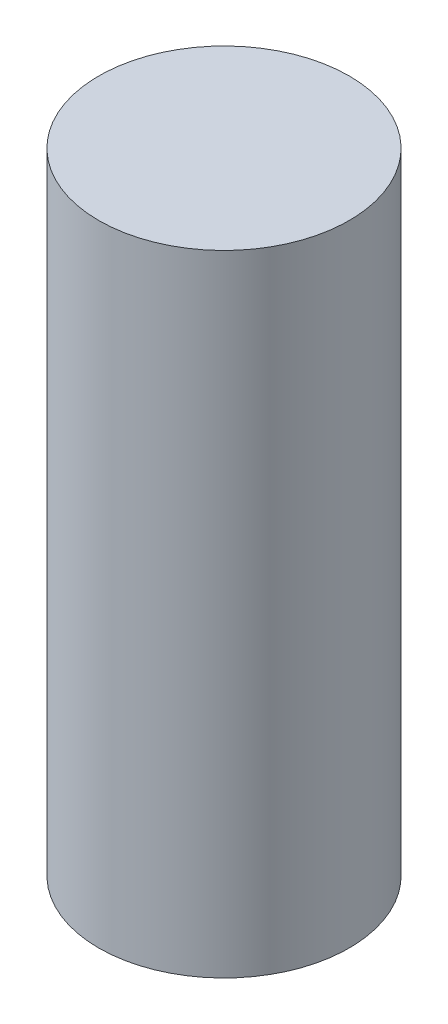
ISO-10303-21;
HEADER;
FILE_DESCRIPTION(('STEP AP214'),'2;1');
FILE_NAME('part.step','',(''),(''),'','','');
FILE_SCHEMA(('AUTOMOTIVE_DESIGN { 1 0 10303 214 1 1 1 1 }'));
ENDSEC;
DATA;
#1=APPLICATION_CONTEXT('core data for automotive mechanical design processes');
#2=APPLICATION_PROTOCOL_DEFINITION('international standard','automotive_design',2000,#1);
#3=PRODUCT_CONTEXT('',#1,'mechanical');
#4=PRODUCT('Part','Part','',(#3));
#5=PRODUCT_RELATED_PRODUCT_CATEGORY('part','',(#4));
#6=PRODUCT_DEFINITION_FORMATION('','',#4);
#7=PRODUCT_DEFINITION_CONTEXT('part definition',#1,'design');
#8=PRODUCT_DEFINITION('design','',#6,#7);
#9=PRODUCT_DEFINITION_SHAPE('','',#8);
#10=(LENGTH_UNIT() NAMED_UNIT(*) SI_UNIT(.MILLI.,.METRE.));
#11=(NAMED_UNIT(*) PLANE_ANGLE_UNIT() SI_UNIT($,.RADIAN.));
#12=(NAMED_UNIT(*) SI_UNIT($,.STERADIAN.) SOLID_ANGLE_UNIT());
#13=UNCERTAINTY_MEASURE_WITH_UNIT(LENGTH_MEASURE(1.E-05),#10,'distance_accuracy_value','');
#14=(GEOMETRIC_REPRESENTATION_CONTEXT(3) GLOBAL_UNCERTAINTY_ASSIGNED_CONTEXT((#13)) GLOBAL_UNIT_ASSIGNED_CONTEXT((#10,
#11,#12)) REPRESENTATION_CONTEXT('',''));
#15=CARTESIAN_POINT('',(0.,0.,0.));
#16=DIRECTION('',(0.,0.,1.));
#17=DIRECTION('',(1.,0.,0.));
#18=AXIS2_PLACEMENT_3D('',#15,#16,#17);
#19=CARTESIAN_POINT('',(0.,80.,0.));
#20=DIRECTION('',(0.,-1.,0.));
#21=DIRECTION('',(0.,0.,-1.));
#22=AXIS2_PLACEMENT_3D('',#19,#20,#21);
#23=CYLINDRICAL_SURFACE('',#22,15.9);
#24=CARTESIAN_POINT('',(0.,80.,0.));
#25=DIRECTION('',(0.,1.,0.));
#26=DIRECTION('',(0.,0.,1.));
#27=AXIS2_PLACEMENT_3D('',#24,#25,#26);
#28=CIRCLE('',#27,15.9);
#29=CARTESIAN_POINT('',(0.,80.,15.9));
#30=VERTEX_POINT('',#29);
#31=EDGE_CURVE('E10',#30,#30,#28,.T.);
#32=ORIENTED_EDGE('',*,*,#31,.F.);
#33=EDGE_LOOP('',(#32));
#34=FACE_BOUND('',#33,.T.);
#35=CARTESIAN_POINT('',(0.,0.,0.));
#36=DIRECTION('',(0.,1.,0.));
#37=DIRECTION('',(0.,0.,1.));
#38=AXIS2_PLACEMENT_3D('',#35,#36,#37);
#39=CIRCLE('',#38,15.9);
#40=CARTESIAN_POINT('',(0.,0.,15.9));
#41=VERTEX_POINT('',#40);
#42=EDGE_CURVE('E32',#41,#41,#39,.T.);
#43=ORIENTED_EDGE('',*,*,#42,.T.);
#44=EDGE_LOOP('',(#43));
#45=FACE_BOUND('',#44,.T.);
#46=ADVANCED_FACE('F29',(#34,#45),#23,.T.);
#47=CARTESIAN_POINT('',(0.,80.,0.));
#48=DIRECTION('',(0.,1.,0.));
#49=DIRECTION('',(0.,0.,1.));
#50=AXIS2_PLACEMENT_3D('',#47,#48,#49);
#51=PLANE('',#50);
#52=ORIENTED_EDGE('',*,*,#31,.T.);
#53=EDGE_LOOP('',(#52));
#54=FACE_BOUND('',#53,.T.);
#55=ADVANCED_FACE('F44',(#54),#51,.T.);
#56=CARTESIAN_POINT('',(0.,0.,0.));
#57=DIRECTION('',(0.,1.,0.));
#58=DIRECTION('',(0.,0.,1.));
#59=AXIS2_PLACEMENT_3D('',#56,#57,#58);
#60=PLANE('',#59);
#61=ORIENTED_EDGE('',*,*,#42,.F.);
#62=EDGE_LOOP('',(#61));
#63=FACE_BOUND('',#62,.T.);
#64=ADVANCED_FACE('F42',(#63),#60,.F.);
#65=CLOSED_SHELL('',(#46,#55,#64));
#66=MANIFOLD_SOLID_BREP('B2',#65);
#67=ADVANCED_BREP_SHAPE_REPRESENTATION('',(#18,#66),#14);
#68=SHAPE_DEFINITION_REPRESENTATION(#9,#67);
ENDSEC;
END-ISO-10303-21;
